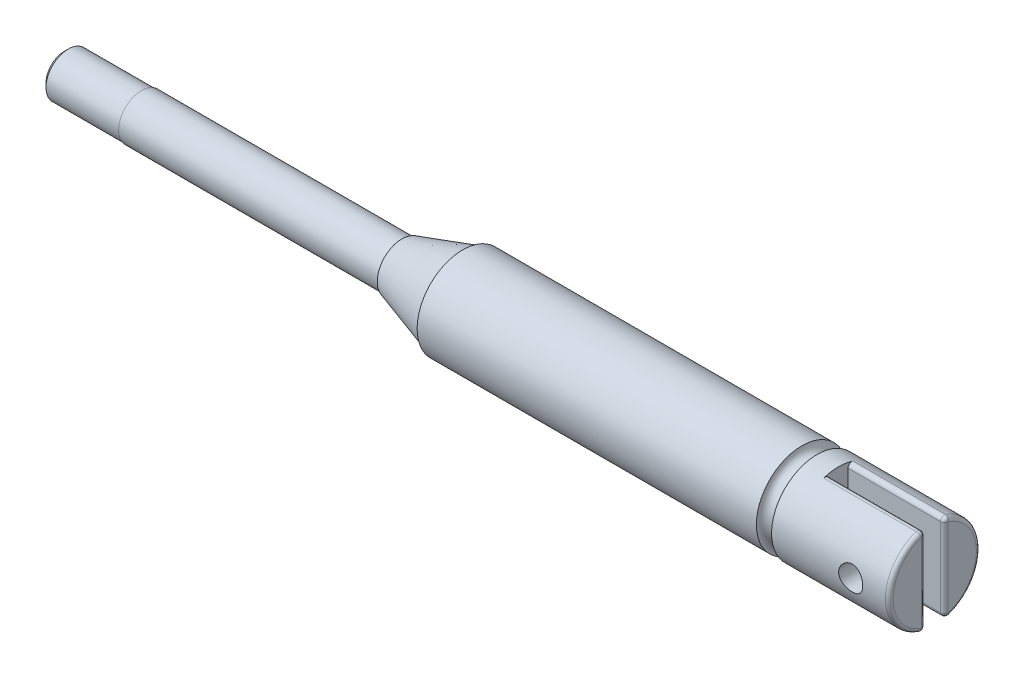
ISO-10303-21;
HEADER;
FILE_DESCRIPTION(('STEP AP214'),'2;1');
FILE_NAME('part.step','',(''),(''),'','','');
FILE_SCHEMA(('AUTOMOTIVE_DESIGN { 1 0 10303 214 1 1 1 1 }'));
ENDSEC;
DATA;
#1=APPLICATION_CONTEXT('core data for automotive mechanical design processes');
#2=APPLICATION_PROTOCOL_DEFINITION('international standard','automotive_design',2000,#1);
#3=PRODUCT_CONTEXT('',#1,'mechanical');
#4=PRODUCT('Part','Part','',(#3));
#5=PRODUCT_RELATED_PRODUCT_CATEGORY('part','',(#4));
#6=PRODUCT_DEFINITION_FORMATION('','',#4);
#7=PRODUCT_DEFINITION_CONTEXT('part definition',#1,'design');
#8=PRODUCT_DEFINITION('design','',#6,#7);
#9=PRODUCT_DEFINITION_SHAPE('','',#8);
#10=(LENGTH_UNIT() NAMED_UNIT(*) SI_UNIT(.MILLI.,.METRE.));
#11=(NAMED_UNIT(*) PLANE_ANGLE_UNIT() SI_UNIT($,.RADIAN.));
#12=(NAMED_UNIT(*) SI_UNIT($,.STERADIAN.) SOLID_ANGLE_UNIT());
#13=UNCERTAINTY_MEASURE_WITH_UNIT(LENGTH_MEASURE(1.E-05),#10,'distance_accuracy_value','');
#14=(GEOMETRIC_REPRESENTATION_CONTEXT(3) GLOBAL_UNCERTAINTY_ASSIGNED_CONTEXT((#13)) GLOBAL_UNIT_ASSIGNED_CONTEXT((#10,
#11,#12)) REPRESENTATION_CONTEXT('',''));
#15=CARTESIAN_POINT('',(0.,0.,0.));
#16=DIRECTION('',(0.,0.,1.));
#17=DIRECTION('',(1.,0.,0.));
#18=AXIS2_PLACEMENT_3D('',#15,#16,#17);
#19=CARTESIAN_POINT('',(-76.0312923411787,0.,0.));
#20=DIRECTION('',(-1.,0.,0.));
#21=DIRECTION('',(0.,-1.,0.));
#22=AXIS2_PLACEMENT_3D('',#19,#20,#21);
#23=CYLINDRICAL_SURFACE('',#22,1.49999999999999);
#24=CARTESIAN_POINT('',(-52.28844,0.,0.));
#25=DIRECTION('',(-1.,0.,0.));
#26=DIRECTION('',(0.,-1.,0.));
#27=AXIS2_PLACEMENT_3D('',#24,#25,#26);
#28=CIRCLE('',#27,1.50000000000001);
#29=CARTESIAN_POINT('',(-52.28844,-1.50000000000001,0.));
#30=VERTEX_POINT('',#29);
#31=EDGE_CURVE('E327',#30,#30,#28,.T.);
#32=ORIENTED_EDGE('',*,*,#31,.F.);
#33=EDGE_LOOP('',(#32));
#34=FACE_BOUND('',#33,.T.);
#35=CARTESIAN_POINT('',(-35.114992,0.,0.));
#36=DIRECTION('',(-1.,0.,0.));
#37=DIRECTION('',(0.,-1.,0.));
#38=AXIS2_PLACEMENT_3D('',#35,#36,#37);
#39=CIRCLE('',#38,1.49999999999999);
#40=CARTESIAN_POINT('',(-35.114992,-1.49999999999998,0.));
#41=VERTEX_POINT('',#40);
#42=EDGE_CURVE('E320',#41,#41,#39,.T.);
#43=ORIENTED_EDGE('',*,*,#42,.T.);
#44=EDGE_LOOP('',(#43));
#45=FACE_BOUND('',#44,.T.);
#46=ADVANCED_FACE('F37',(#34,#45),#23,.T.);
#47=CARTESIAN_POINT('',(-35.114992,1.627,0.));
#48=DIRECTION('',(1.,0.,0.));
#49=DIRECTION('',(0.,1.,0.));
#50=AXIS2_PLACEMENT_3D('',#47,#48,#49);
#51=PLANE('',#50);
#52=ORIENTED_EDGE('',*,*,#42,.F.);
#53=EDGE_LOOP('',(#52));
#54=FACE_BOUND('',#53,.T.);
#55=CARTESIAN_POINT('',(-35.114992,0.,0.));
#56=DIRECTION('',(-1.,0.,0.));
#57=DIRECTION('',(0.,-1.,0.));
#58=AXIS2_PLACEMENT_3D('',#55,#56,#57);
#59=CIRCLE('',#58,1.62699999999999);
#60=CARTESIAN_POINT('',(-35.114992,-1.62699999999998,0.));
#61=VERTEX_POINT('',#60);
#62=EDGE_CURVE('E567',#61,#61,#59,.T.);
#63=ORIENTED_EDGE('',*,*,#62,.T.);
#64=EDGE_LOOP('',(#63));
#65=FACE_BOUND('',#64,.T.);
#66=ADVANCED_FACE('F235',(#54,#65),#51,.F.);
#67=CARTESIAN_POINT('',(-31.115,0.,0.));
#68=DIRECTION('',(1.,0.,0.));
#69=DIRECTION('',(0.,1.,0.));
#70=AXIS2_PLACEMENT_3D('',#67,#68,#69);
#71=CONICAL_SURFACE('',#70,2.87299999999999,0.301974145053179);
#72=ORIENTED_EDGE('',*,*,#62,.F.);
#73=EDGE_LOOP('',(#72));
#74=FACE_BOUND('',#73,.T.);
#75=CARTESIAN_POINT('',(-31.115,0.,0.));
#76=DIRECTION('',(-1.,0.,0.));
#77=DIRECTION('',(0.,-1.,0.));
#78=AXIS2_PLACEMENT_3D('',#75,#76,#77);
#79=CIRCLE('',#78,2.87299999999999);
#80=CARTESIAN_POINT('',(-31.115,-2.87299999999998,0.));
#81=VERTEX_POINT('',#80);
#82=EDGE_CURVE('E562',#81,#81,#79,.T.);
#83=ORIENTED_EDGE('',*,*,#82,.T.);
#84=EDGE_LOOP('',(#83));
#85=FACE_BOUND('',#84,.T.);
#86=ADVANCED_FACE('F241',(#74,#85),#71,.T.);
#87=CARTESIAN_POINT('',(-31.115,3.,0.));
#88=DIRECTION('',(1.,0.,0.));
#89=DIRECTION('',(0.,1.,0.));
#90=AXIS2_PLACEMENT_3D('',#87,#88,#89);
#91=PLANE('',#90);
#92=ORIENTED_EDGE('',*,*,#82,.F.);
#93=EDGE_LOOP('',(#92));
#94=FACE_BOUND('',#93,.T.);
#95=CARTESIAN_POINT('',(-31.115,0.,0.));
#96=DIRECTION('',(-1.,0.,0.));
#97=DIRECTION('',(0.,-1.,0.));
#98=AXIS2_PLACEMENT_3D('',#95,#96,#97);
#99=CIRCLE('',#98,2.99999999999999);
#100=CARTESIAN_POINT('',(-31.115,-2.99999999999998,0.));
#101=VERTEX_POINT('',#100);
#102=EDGE_CURVE('E308',#101,#101,#99,.T.);
#103=ORIENTED_EDGE('',*,*,#102,.T.);
#104=EDGE_LOOP('',(#103));
#105=FACE_BOUND('',#104,.T.);
#106=ADVANCED_FACE('F460',(#94,#105),#91,.F.);
#107=CARTESIAN_POINT('',(-76.0312923411787,0.,0.));
#108=DIRECTION('',(-1.,0.,0.));
#109=DIRECTION('',(0.,-1.,0.));
#110=AXIS2_PLACEMENT_3D('',#107,#108,#109);
#111=CYLINDRICAL_SURFACE('',#110,2.99999999999999);
#112=CARTESIAN_POINT('',(-8.755,0.,0.));
#113=DIRECTION('',(1.,0.,0.));
#114=DIRECTION('',(0.,1.,0.));
#115=AXIS2_PLACEMENT_3D('',#112,#113,#114);
#116=CIRCLE('',#115,2.99999999999999);
#117=CARTESIAN_POINT('',(-8.755,3.,0.));
#118=VERTEX_POINT('',#117);
#119=EDGE_CURVE('E209',#118,#118,#116,.F.);
#120=ORIENTED_EDGE('',*,*,#119,.T.);
#121=EDGE_LOOP('',(#120));
#122=FACE_BOUND('',#121,.T.);
#123=ORIENTED_EDGE('',*,*,#102,.F.);
#124=EDGE_LOOP('',(#123));
#125=FACE_BOUND('',#124,.T.);
#126=ADVANCED_FACE('F336',(#122,#125),#111,.T.);
#127=CARTESIAN_POINT('',(-63.4330682425012,0.,0.));
#128=DIRECTION('',(-1.,0.,0.));
#129=DIRECTION('',(0.,-1.,0.));
#130=AXIS2_PLACEMENT_3D('',#127,#128,#129);
#131=CYLINDRICAL_SURFACE('',#130,1.4605);
#132=CARTESIAN_POINT('',(-57.11444,0.,0.));
#133=DIRECTION('',(1.,0.,0.));
#134=DIRECTION('',(0.,1.,0.));
#135=AXIS2_PLACEMENT_3D('',#132,#133,#134);
#136=CIRCLE('',#135,1.4605);
#137=CARTESIAN_POINT('',(-57.11444,1.4605,0.));
#138=VERTEX_POINT('',#137);
#139=EDGE_CURVE('E148',#138,#138,#136,.T.);
#140=ORIENTED_EDGE('',*,*,#139,.T.);
#141=EDGE_LOOP('',(#140));
#142=FACE_BOUND('',#141,.T.);
#143=CARTESIAN_POINT('',(-52.28844,0.,0.));
#144=DIRECTION('',(-1.,0.,0.));
#145=DIRECTION('',(0.,-1.,0.));
#146=AXIS2_PLACEMENT_3D('',#143,#144,#145);
#147=CIRCLE('',#146,1.4605);
#148=CARTESIAN_POINT('',(-52.28844,-1.4605,0.));
#149=VERTEX_POINT('',#148);
#150=EDGE_CURVE('E196',#149,#149,#147,.T.);
#151=ORIENTED_EDGE('',*,*,#150,.T.);
#152=EDGE_LOOP('',(#151));
#153=FACE_BOUND('',#152,.T.);
#154=ADVANCED_FACE('F331',(#142,#153),#131,.T.);
#155=CARTESIAN_POINT('',(-52.28844,1.50000000000001,0.));
#156=DIRECTION('',(1.,0.,0.));
#157=DIRECTION('',(0.,1.,0.));
#158=AXIS2_PLACEMENT_3D('',#155,#156,#157);
#159=PLANE('',#158);
#160=ORIENTED_EDGE('',*,*,#150,.F.);
#161=EDGE_LOOP('',(#160));
#162=FACE_BOUND('',#161,.T.);
#163=ORIENTED_EDGE('',*,*,#31,.T.);
#164=EDGE_LOOP('',(#163));
#165=FACE_BOUND('',#164,.T.);
#166=ADVANCED_FACE('F249',(#162,#165),#159,.F.);
#167=CARTESIAN_POINT('',(-57.36844,0.,0.));
#168=DIRECTION('',(1.,0.,0.));
#169=DIRECTION('',(0.,1.,0.));
#170=AXIS2_PLACEMENT_3D('',#167,#168,#169);
#171=PLANE('',#170);
#172=CARTESIAN_POINT('',(-57.36844,0.,0.));
#173=DIRECTION('',(1.,0.,0.));
#174=DIRECTION('',(0.,1.,0.));
#175=AXIS2_PLACEMENT_3D('',#172,#173,#174);
#176=CIRCLE('',#175,1.20649999999999);
#177=CARTESIAN_POINT('',(-57.36844,1.20649999999999,0.));
#178=VERTEX_POINT('',#177);
#179=EDGE_CURVE('E315',#178,#178,#176,.F.);
#180=ORIENTED_EDGE('',*,*,#179,.T.);
#181=EDGE_LOOP('',(#180));
#182=FACE_BOUND('',#181,.T.);
#183=ADVANCED_FACE('F230',(#182),#171,.F.);
#184=CARTESIAN_POINT('',(-57.36844,0.,0.));
#185=DIRECTION('',(1.,0.,0.));
#186=DIRECTION('',(0.,1.,0.));
#187=AXIS2_PLACEMENT_3D('',#184,#185,#186);
#188=CONICAL_SURFACE('',#187,1.20649999999999,0.785398163397466);
#189=ORIENTED_EDGE('',*,*,#139,.F.);
#190=EDGE_LOOP('',(#189));
#191=FACE_BOUND('',#190,.T.);
#192=ORIENTED_EDGE('',*,*,#179,.F.);
#193=EDGE_LOOP('',(#192));
#194=FACE_BOUND('',#193,.T.);
#195=ADVANCED_FACE('F222',(#191,#194),#188,.T.);
#196=CARTESIAN_POINT('',(-8.255,0.,0.));
#197=DIRECTION('',(1.,0.,0.));
#198=DIRECTION('',(0.,1.,0.));
#199=AXIS2_PLACEMENT_3D('',#196,#197,#198);
#200=TOROIDAL_SURFACE('',#199,2.99999999999999,0.500000000000001);
#201=ORIENTED_EDGE('',*,*,#119,.F.);
#202=EDGE_LOOP('',(#201));
#203=FACE_BOUND('',#202,.T.);
#204=CARTESIAN_POINT('',(-7.755,0.,0.));
#205=DIRECTION('',(-1.,0.,0.));
#206=DIRECTION('',(0.,-1.,0.));
#207=AXIS2_PLACEMENT_3D('',#204,#205,#206);
#208=CIRCLE('',#207,2.99999999999999);
#209=CARTESIAN_POINT('',(-7.755,-2.99999999999997,0.));
#210=VERTEX_POINT('',#209);
#211=EDGE_CURVE('E41',#210,#210,#208,.F.);
#212=ORIENTED_EDGE('',*,*,#211,.F.);
#213=EDGE_LOOP('',(#212));
#214=FACE_BOUND('',#213,.T.);
#215=ADVANCED_FACE('F219',(#203,#214),#200,.F.);
#216=CARTESIAN_POINT('',(-0.254,0.,0.889));
#217=DIRECTION('',(0.,1.,0.));
#218=DIRECTION('',(-1.,0.,0.));
#219=AXIS2_PLACEMENT_3D('',#216,#217,#218);
#220=CYLINDRICAL_SURFACE('',#219,0.254);
#221=CARTESIAN_POINT('',(-0.253999999999999,-2.59811373884976,0.889));
#222=DIRECTION('',(0.,-1.,0.));
#223=DIRECTION('',(1.,0.,0.));
#224=AXIS2_PLACEMENT_3D('',#221,#222,#223);
#225=CIRCLE('',#224,0.254);
#226=CARTESIAN_POINT('',(0.,-2.59811373884976,0.889));
#227=VERTEX_POINT('',#226);
#228=CARTESIAN_POINT('',(-0.253999999999999,-2.59811373884976,0.635));
#229=VERTEX_POINT('',#228);
#230=EDGE_CURVE('E54',#227,#229,#225,.F.);
#231=ORIENTED_EDGE('',*,*,#230,.T.);
#232=DIRECTION('',(0.,1.,0.));
#233=VECTOR('',#232,1.);
#234=CARTESIAN_POINT('',(-0.253999999999999,-2.99999999999998,0.635));
#235=LINE('',#234,#233);
#236=CARTESIAN_POINT('',(-0.254,2.59811373884978,0.635));
#237=VERTEX_POINT('',#236);
#238=EDGE_CURVE('E179',#237,#229,#235,.F.);
#239=ORIENTED_EDGE('',*,*,#238,.F.);
#240=CARTESIAN_POINT('',(-0.254,2.59811373884978,0.889));
#241=DIRECTION('',(0.,1.,0.));
#242=DIRECTION('',(0.,0.,1.));
#243=AXIS2_PLACEMENT_3D('',#240,#241,#242);
#244=CIRCLE('',#243,0.254);
#245=CARTESIAN_POINT('',(0.,2.59811373884978,0.889));
#246=VERTEX_POINT('',#245);
#247=EDGE_CURVE('E197',#237,#246,#244,.F.);
#248=ORIENTED_EDGE('',*,*,#247,.T.);
#249=DIRECTION('',(0.,1.,0.));
#250=VECTOR('',#249,1.);
#251=CARTESIAN_POINT('',(0.,0.,0.889));
#252=LINE('',#251,#250);
#253=EDGE_CURVE('E175',#227,#246,#252,.T.);
#254=ORIENTED_EDGE('',*,*,#253,.F.);
#255=EDGE_LOOP('',(#231,#239,#248,#254));
#256=FACE_BOUND('',#255,.T.);
#257=ADVANCED_FACE('F221',(#256),#220,.T.);
#258=CARTESIAN_POINT('',(-0.254,0.,-0.889));
#259=DIRECTION('',(0.,-1.,0.));
#260=DIRECTION('',(1.,0.,0.));
#261=AXIS2_PLACEMENT_3D('',#258,#259,#260);
#262=CYLINDRICAL_SURFACE('',#261,0.254);
#263=CARTESIAN_POINT('',(-0.254,2.59811373884978,-0.889));
#264=DIRECTION('',(0.,1.,0.));
#265=DIRECTION('',(-1.,0.,0.));
#266=AXIS2_PLACEMENT_3D('',#263,#264,#265);
#267=CIRCLE('',#266,0.254);
#268=CARTESIAN_POINT('',(0.,2.59811373884978,-0.889));
#269=VERTEX_POINT('',#268);
#270=CARTESIAN_POINT('',(-0.254,2.59811373884978,-0.635));
#271=VERTEX_POINT('',#270);
#272=EDGE_CURVE('E129',#269,#271,#267,.F.);
#273=ORIENTED_EDGE('',*,*,#272,.T.);
#274=DIRECTION('',(0.,-1.,0.));
#275=VECTOR('',#274,1.);
#276=CARTESIAN_POINT('',(-0.253999999999999,-2.99999999999998,-0.635));
#277=LINE('',#276,#275);
#278=CARTESIAN_POINT('',(-0.253999999999999,-2.59811373884976,-0.635));
#279=VERTEX_POINT('',#278);
#280=EDGE_CURVE('E126',#279,#271,#277,.F.);
#281=ORIENTED_EDGE('',*,*,#280,.F.);
#282=CARTESIAN_POINT('',(-0.253999999999999,-2.59811373884976,-0.889));
#283=DIRECTION('',(0.,-1.,0.));
#284=DIRECTION('',(0.,0.,-1.));
#285=AXIS2_PLACEMENT_3D('',#282,#283,#284);
#286=CIRCLE('',#285,0.254);
#287=CARTESIAN_POINT('',(0.,-2.59811373884976,-0.889));
#288=VERTEX_POINT('',#287);
#289=EDGE_CURVE('E120',#279,#288,#286,.F.);
#290=ORIENTED_EDGE('',*,*,#289,.T.);
#291=DIRECTION('',(0.,-1.,0.));
#292=VECTOR('',#291,1.);
#293=CARTESIAN_POINT('',(0.,0.,-0.889));
#294=LINE('',#293,#292);
#295=EDGE_CURVE('E124',#269,#288,#294,.T.);
#296=ORIENTED_EDGE('',*,*,#295,.F.);
#297=EDGE_LOOP('',(#273,#281,#290,#296));
#298=FACE_BOUND('',#297,.T.);
#299=ADVANCED_FACE('F122',(#298),#262,.T.);
#300=CARTESIAN_POINT('',(0.,0.,0.));
#301=DIRECTION('',(-1.,0.,0.));
#302=DIRECTION('',(0.,-1.,0.));
#303=AXIS2_PLACEMENT_3D('',#300,#301,#302);
#304=PLANE('',#303);
#305=CARTESIAN_POINT('',(0.,0.,0.));
#306=DIRECTION('',(-1.,0.,0.));
#307=DIRECTION('',(0.,-1.,0.));
#308=AXIS2_PLACEMENT_3D('',#305,#306,#307);
#309=CIRCLE('',#308,2.74599999999999);
#310=EDGE_CURVE('E143',#288,#269,#309,.F.);
#311=ORIENTED_EDGE('',*,*,#310,.T.);
#312=ORIENTED_EDGE('',*,*,#295,.T.);
#313=EDGE_LOOP('',(#311,#312));
#314=FACE_BOUND('',#313,.T.);
#315=ADVANCED_FACE('F150',(#314),#304,.F.);
#316=CARTESIAN_POINT('',(-0.254,2.59811373884978,-0.889));
#317=DIRECTION('',(0.,0.,1.));
#318=DIRECTION('',(1.,0.,0.));
#319=AXIS2_PLACEMENT_3D('',#316,#317,#318);
#320=SPHERICAL_SURFACE('',#319,0.254);
#321=CARTESIAN_POINT('',(-0.254,2.59811373884978,-0.889));
#322=DIRECTION('',(0.,0.323743627093956,0.946144842989724));
#323=DIRECTION('',(0.,-0.946144842989724,0.323743627093956));
#324=AXIS2_PLACEMENT_3D('',#321,#322,#323);
#325=CIRCLE('',#324,0.254);
#326=CARTESIAN_POINT('',(-0.254000000000005,2.83843452896917,-0.971230881281865));
#327=VERTEX_POINT('',#326);
#328=EDGE_CURVE('E140',#269,#327,#325,.T.);
#329=ORIENTED_EDGE('',*,*,#328,.T.);
#330=CARTESIAN_POINT('',(-0.254000000000005,2.59811373884978,-0.889));
#331=DIRECTION('',(1.,0.,0.));
#332=DIRECTION('',(0.,0.,-1.));
#333=AXIS2_PLACEMENT_3D('',#330,#331,#332);
#334=CIRCLE('',#333,0.254);
#335=EDGE_CURVE('E193',#327,#271,#334,.T.);
#336=ORIENTED_EDGE('',*,*,#335,.T.);
#337=ORIENTED_EDGE('',*,*,#272,.F.);
#338=EDGE_LOOP('',(#329,#336,#337));
#339=FACE_BOUND('',#338,.T.);
#340=ADVANCED_FACE('F258',(#339),#320,.T.);
#341=CARTESIAN_POINT('',(0.,0.,0.));
#342=DIRECTION('',(-1.,0.,0.));
#343=DIRECTION('',(0.,-1.,0.));
#344=AXIS2_PLACEMENT_3D('',#341,#342,#343);
#345=CIRCLE('',#344,2.74599999999999);
#346=EDGE_CURVE('E173',#246,#227,#345,.F.);
#347=ORIENTED_EDGE('',*,*,#346,.T.);
#348=ORIENTED_EDGE('',*,*,#253,.T.);
#349=EDGE_LOOP('',(#347,#348));
#350=FACE_BOUND('',#349,.T.);
#351=ADVANCED_FACE('F261',(#350),#304,.F.);
#352=CARTESIAN_POINT('',(-0.254,2.59811373884978,0.889));
#353=DIRECTION('',(0.,0.,1.));
#354=DIRECTION('',(1.,0.,0.));
#355=AXIS2_PLACEMENT_3D('',#352,#353,#354);
#356=SPHERICAL_SURFACE('',#355,0.254);
#357=CARTESIAN_POINT('',(-0.254,2.59811373884978,0.889));
#358=DIRECTION('',(1.,0.,0.));
#359=DIRECTION('',(0.,1.,0.));
#360=AXIS2_PLACEMENT_3D('',#357,#358,#359);
#361=CIRCLE('',#360,0.254);
#362=CARTESIAN_POINT('',(-0.254000000000005,2.83843452896917,0.971230881281865));
#363=VERTEX_POINT('',#362);
#364=EDGE_CURVE('E200',#237,#363,#361,.T.);
#365=ORIENTED_EDGE('',*,*,#364,.T.);
#366=CARTESIAN_POINT('',(-0.254000000000005,2.59811373884978,0.889));
#367=DIRECTION('',(0.,0.323743627093956,-0.946144842989724));
#368=DIRECTION('',(0.,0.946144842989724,0.323743627093956));
#369=AXIS2_PLACEMENT_3D('',#366,#367,#368);
#370=CIRCLE('',#369,0.254);
#371=EDGE_CURVE('E203',#363,#246,#370,.T.);
#372=ORIENTED_EDGE('',*,*,#371,.T.);
#373=ORIENTED_EDGE('',*,*,#247,.F.);
#374=EDGE_LOOP('',(#365,#372,#373));
#375=FACE_BOUND('',#374,.T.);
#376=ADVANCED_FACE('F276',(#375),#356,.T.);
#377=CARTESIAN_POINT('',(-0.253999999999999,-2.59811373884976,0.889));
#378=DIRECTION('',(0.,0.,1.));
#379=DIRECTION('',(1.,0.,0.));
#380=AXIS2_PLACEMENT_3D('',#377,#378,#379);
#381=SPHERICAL_SURFACE('',#380,0.254);
#382=CARTESIAN_POINT('',(-0.253999999999999,-2.59811373884976,0.889));
#383=DIRECTION('',(0.,-0.323743627093956,-0.946144842989724));
#384=DIRECTION('',(0.,0.946144842989724,-0.323743627093956));
#385=AXIS2_PLACEMENT_3D('',#382,#383,#384);
#386=CIRCLE('',#385,0.254);
#387=CARTESIAN_POINT('',(-0.254000000000004,-2.83843452896915,0.971230881281865));
#388=VERTEX_POINT('',#387);
#389=EDGE_CURVE('E206',#227,#388,#386,.T.);
#390=ORIENTED_EDGE('',*,*,#389,.T.);
#391=CARTESIAN_POINT('',(-0.254000000000004,-2.59811373884976,0.889));
#392=DIRECTION('',(1.,0.,0.));
#393=DIRECTION('',(0.,0.,-1.));
#394=AXIS2_PLACEMENT_3D('',#391,#392,#393);
#395=CIRCLE('',#394,0.254);
#396=EDGE_CURVE('E130',#388,#229,#395,.T.);
#397=ORIENTED_EDGE('',*,*,#396,.T.);
#398=ORIENTED_EDGE('',*,*,#230,.F.);
#399=EDGE_LOOP('',(#390,#397,#398));
#400=FACE_BOUND('',#399,.T.);
#401=ADVANCED_FACE('F279',(#400),#381,.T.);
#402=CARTESIAN_POINT('',(-6.35,-2.99999999999998,0.635));
#403=DIRECTION('',(0.,0.,1.));
#404=DIRECTION('',(1.,0.,0.));
#405=AXIS2_PLACEMENT_3D('',#402,#403,#404);
#406=PLANE('',#405);
#407=CARTESIAN_POINT('',(-2.54,0.,0.635));
#408=DIRECTION('',(0.,0.,1.));
#409=DIRECTION('',(1.,0.,0.));
#410=AXIS2_PLACEMENT_3D('',#407,#408,#409);
#411=CIRCLE('',#410,0.79375);
#412=CARTESIAN_POINT('',(-1.74625,0.,0.635));
#413=VERTEX_POINT('',#412);
#414=EDGE_CURVE('E326',#413,#413,#411,.T.);
#415=ORIENTED_EDGE('',*,*,#414,.T.);
#416=EDGE_LOOP('',(#415));
#417=FACE_BOUND('',#416,.T.);
#418=ORIENTED_EDGE('',*,*,#238,.T.);
#419=DIRECTION('',(-1.,0.,0.));
#420=VECTOR('',#419,1.);
#421=CARTESIAN_POINT('',(-6.35,-2.59811373884976,0.635));
#422=LINE('',#421,#420);
#423=CARTESIAN_POINT('',(-6.35,-2.59811373884976,0.635));
#424=VERTEX_POINT('',#423);
#425=EDGE_CURVE('E181',#229,#424,#422,.T.);
#426=ORIENTED_EDGE('',*,*,#425,.T.);
#427=DIRECTION('',(0.,1.,0.));
#428=VECTOR('',#427,1.);
#429=CARTESIAN_POINT('',(-6.35,-2.99999999999998,0.635));
#430=LINE('',#429,#428);
#431=CARTESIAN_POINT('',(-6.35,2.59811373884978,0.635));
#432=VERTEX_POINT('',#431);
#433=EDGE_CURVE('E304',#424,#432,#430,.T.);
#434=ORIENTED_EDGE('',*,*,#433,.T.);
#435=DIRECTION('',(-1.,0.,0.));
#436=VECTOR('',#435,1.);
#437=CARTESIAN_POINT('',(-6.35,2.59811373884978,0.635));
#438=LINE('',#437,#436);
#439=EDGE_CURVE('E62',#432,#237,#438,.F.);
#440=ORIENTED_EDGE('',*,*,#439,.T.);
#441=EDGE_LOOP('',(#418,#426,#434,#440));
#442=FACE_BOUND('',#441,.T.);
#443=ADVANCED_FACE('F283',(#417,#442),#406,.F.);
#444=CARTESIAN_POINT('',(-6.35,-2.99999999999998,-0.635));
#445=DIRECTION('',(0.,0.,-1.));
#446=DIRECTION('',(-1.,0.,0.));
#447=AXIS2_PLACEMENT_3D('',#444,#445,#446);
#448=PLANE('',#447);
#449=CARTESIAN_POINT('',(-2.54,0.,-0.635));
#450=DIRECTION('',(0.,0.,-1.));
#451=DIRECTION('',(-1.,0.,0.));
#452=AXIS2_PLACEMENT_3D('',#449,#450,#451);
#453=CIRCLE('',#452,0.79375);
#454=CARTESIAN_POINT('',(-3.33375,0.,-0.635));
#455=VERTEX_POINT('',#454);
#456=EDGE_CURVE('E324',#455,#455,#453,.T.);
#457=ORIENTED_EDGE('',*,*,#456,.T.);
#458=EDGE_LOOP('',(#457));
#459=FACE_BOUND('',#458,.T.);
#460=DIRECTION('',(0.,1.,0.));
#461=VECTOR('',#460,1.);
#462=CARTESIAN_POINT('',(-6.35,-2.99999999999998,-0.635));
#463=LINE('',#462,#461);
#464=CARTESIAN_POINT('',(-6.35,-2.59811373884976,-0.635));
#465=VERTEX_POINT('',#464);
#466=CARTESIAN_POINT('',(-6.35,2.59811373884978,-0.635));
#467=VERTEX_POINT('',#466);
#468=EDGE_CURVE('E309',#465,#467,#463,.T.);
#469=ORIENTED_EDGE('',*,*,#468,.F.);
#470=DIRECTION('',(-1.,0.,0.));
#471=VECTOR('',#470,1.);
#472=CARTESIAN_POINT('',(-6.35,-2.59811373884976,-0.635));
#473=LINE('',#472,#471);
#474=EDGE_CURVE('E157',#465,#279,#473,.F.);
#475=ORIENTED_EDGE('',*,*,#474,.T.);
#476=ORIENTED_EDGE('',*,*,#280,.T.);
#477=DIRECTION('',(-1.,0.,0.));
#478=VECTOR('',#477,1.);
#479=CARTESIAN_POINT('',(-6.35,2.59811373884978,-0.635));
#480=LINE('',#479,#478);
#481=EDGE_CURVE('E151',#271,#467,#480,.T.);
#482=ORIENTED_EDGE('',*,*,#481,.T.);
#483=EDGE_LOOP('',(#469,#475,#476,#482));
#484=FACE_BOUND('',#483,.T.);
#485=ADVANCED_FACE('F257',(#459,#484),#448,.F.);
#486=CARTESIAN_POINT('',(-0.253999999999999,-2.59811373884976,-0.889));
#487=DIRECTION('',(0.,0.,1.));
#488=DIRECTION('',(1.,0.,0.));
#489=AXIS2_PLACEMENT_3D('',#486,#487,#488);
#490=SPHERICAL_SURFACE('',#489,0.254);
#491=CARTESIAN_POINT('',(-0.253999999999999,-2.59811373884976,-0.889));
#492=DIRECTION('',(1.,0.,0.));
#493=DIRECTION('',(0.,1.,0.));
#494=AXIS2_PLACEMENT_3D('',#491,#492,#493);
#495=CIRCLE('',#494,0.254);
#496=CARTESIAN_POINT('',(-0.254000000000004,-2.83843452896915,-0.971230881281865));
#497=VERTEX_POINT('',#496);
#498=EDGE_CURVE('E137',#279,#497,#495,.T.);
#499=ORIENTED_EDGE('',*,*,#498,.T.);
#500=CARTESIAN_POINT('',(-0.254000000000004,-2.59811373884976,-0.889));
#501=DIRECTION('',(0.,-0.323743627093957,0.946144842989724));
#502=DIRECTION('',(0.,-0.946144842989724,-0.323743627093957));
#503=AXIS2_PLACEMENT_3D('',#500,#501,#502);
#504=CIRCLE('',#503,0.254);
#505=EDGE_CURVE('E133',#497,#288,#504,.T.);
#506=ORIENTED_EDGE('',*,*,#505,.T.);
#507=ORIENTED_EDGE('',*,*,#289,.F.);
#508=EDGE_LOOP('',(#499,#506,#507));
#509=FACE_BOUND('',#508,.T.);
#510=ADVANCED_FACE('F135',(#509),#490,.T.);
#511=CARTESIAN_POINT('',(-2.54,0.,-2.99999999999999));
#512=DIRECTION('',(0.,0.,1.));
#513=DIRECTION('',(1.,0.,0.));
#514=AXIS2_PLACEMENT_3D('',#511,#512,#513);
#515=CYLINDRICAL_SURFACE('',#514,0.79375);
#516=ORIENTED_EDGE('',*,*,#456,.F.);
#517=EDGE_LOOP('',(#516));
#518=FACE_BOUND('',#517,.T.);
#519=CARTESIAN_POINT('',(-1.74625,0.,-2.99999999999999));
#520=CARTESIAN_POINT('',(-1.74625106466458,0.0437698375668157,-2.9999993282264));
#521=CARTESIAN_POINT('',(-1.74988254999377,0.0875511439939445,-2.99903265897856));
#522=CARTESIAN_POINT('',(-1.76428734018329,0.17385336792853,-2.9952702766813));
#523=CARTESIAN_POINT('',(-1.7750641600128,0.216373654348215,-2.99247366344542));
#524=CARTESIAN_POINT('',(-1.80338534416475,0.298895558183938,-2.98536019494753));
#525=CARTESIAN_POINT('',(-1.82092105910498,0.338900318931544,-2.9810452832695));
#526=CARTESIAN_POINT('',(-1.86223040276898,0.415400954854202,-2.97135167835241));
#527=CARTESIAN_POINT('',(-1.88600442136328,0.45189661052852,-2.96597291863203));
#528=CARTESIAN_POINT('',(-1.93968923528594,0.521177198313556,-2.95459529167835));
#529=CARTESIAN_POINT('',(-1.96971606590674,0.553870498840004,-2.948585955456));
#530=CARTESIAN_POINT('',(-2.03480605532623,0.613821062476154,-2.93669198347927));
#531=CARTESIAN_POINT('',(-2.06986985088904,0.641077637242554,-2.93080736359941));
#532=CARTESIAN_POINT('',(-2.14476729320822,0.689825783926276,-2.91972221312683));
#533=CARTESIAN_POINT('',(-2.1846714436118,0.711212314583401,-2.91453490163149));
#534=CARTESIAN_POINT('',(-2.26766841339288,0.746936853108402,-2.90558545856868));
#535=CARTESIAN_POINT('',(-2.31076065333328,0.761276138213968,-2.90182306877781));
#536=CARTESIAN_POINT('',(-2.39789667894256,0.782181634058109,-2.89625748536585));
#537=CARTESIAN_POINT('',(-2.44189791653429,0.788913803347784,-2.89441253550613));
#538=CARTESIAN_POINT('',(-2.53044095911576,0.794931306686499,-2.89276593751789));
#539=CARTESIAN_POINT('',(-2.57498266329633,0.794218008787497,-2.89296391401602));
#540=CARTESIAN_POINT('',(-2.66204993546567,0.785496664193203,-2.89534340740742));
#541=CARTESIAN_POINT('',(-2.70459730494513,0.777689037954792,-2.89747042426131));
#542=CARTESIAN_POINT('',(-2.78775562385429,0.755321500880883,-2.90338112457289));
#543=CARTESIAN_POINT('',(-2.82836642039022,0.740761057876009,-2.90716493859651));
#544=CARTESIAN_POINT('',(-2.90702314199696,0.705136935568971,-2.91601108429069));
#545=CARTESIAN_POINT('',(-2.94503548852245,0.684002677548692,-2.92108717740622));
#546=CARTESIAN_POINT('',(-3.01704483448691,0.635880102873265,-2.93193848850909));
#547=CARTESIAN_POINT('',(-3.05104105267015,0.608890650096443,-2.93771384208226));
#548=CARTESIAN_POINT('',(-3.11519864441466,0.548797335418491,-2.94954012997449));
#549=CARTESIAN_POINT('',(-3.14520196174313,0.515525063857159,-2.95559396059681));
#550=CARTESIAN_POINT('',(-3.19923505967777,0.444347463545209,-2.96712878584985));
#551=CARTESIAN_POINT('',(-3.22326461205786,0.406441957865631,-2.97260975859004));
#552=CARTESIAN_POINT('',(-3.26473616217239,0.326831593122855,-2.98241416327767));
#553=CARTESIAN_POINT('',(-3.28214993361147,0.285111376395161,-2.98673261299293));
#554=CARTESIAN_POINT('',(-3.30967123600047,0.199195346207609,-2.99368936208497));
#555=CARTESIAN_POINT('',(-3.31978033782868,0.155000067217067,-2.99632802268796));
#556=CARTESIAN_POINT('',(-3.3321580429915,0.0667376523615833,-2.99957341029864));
#557=CARTESIAN_POINT('',(-3.33464158096443,0.0227026605941382,-3.00023582426948));
#558=CARTESIAN_POINT('',(-3.33229070813109,-0.065154514564261,-2.99961399386761));
#559=CARTESIAN_POINT('',(-3.32745704105676,-0.108976719129068,-2.99832994733612));
#560=CARTESIAN_POINT('',(-3.31078538041926,-0.194399831758913,-2.99399540566287));
#561=CARTESIAN_POINT('',(-3.29906693342828,-0.23602574225483,-2.99097507794908));
#562=CARTESIAN_POINT('',(-3.26909688819508,-0.316717136609313,-2.98351028151612));
#563=CARTESIAN_POINT('',(-3.25084458770102,-0.355782344712057,-2.97906565972068));
#564=CARTESIAN_POINT('',(-3.20792399340457,-0.431081141367528,-2.96911443505799));
#565=CARTESIAN_POINT('',(-3.18313832885425,-0.467245269078571,-2.9635889383961));
#566=CARTESIAN_POINT('',(-3.12800244880278,-0.534976580546292,-2.95211485449207));
#567=CARTESIAN_POINT('',(-3.09765115191606,-0.566542868814267,-2.94616618516646));
#568=CARTESIAN_POINT('',(-3.03124314635651,-0.625085613836346,-2.93431188392032));
#569=CARTESIAN_POINT('',(-2.9950515704678,-0.651910529668655,-2.92841201919743));
#570=CARTESIAN_POINT('',(-2.91855627980036,-0.699109160049003,-2.91750500029281));
#571=CARTESIAN_POINT('',(-2.8782527386848,-0.719483146894132,-2.9124978084348));
#572=CARTESIAN_POINT('',(-2.79488111093695,-0.753048198559642,-2.90400040127052));
#573=CARTESIAN_POINT('',(-2.75183079398742,-0.766281053140331,-2.9005013849586));
#574=CARTESIAN_POINT('',(-2.66400796337882,-0.785288661572236,-2.89541367903229));
#575=CARTESIAN_POINT('',(-2.61923588440283,-0.791065285289,-2.89382451047521));
#576=CARTESIAN_POINT('',(-2.53079068680283,-0.794890137295294,-2.89277599719909));
#577=CARTESIAN_POINT('',(-2.48712872977834,-0.793181751627871,-2.893249576234));
#578=CARTESIAN_POINT('',(-2.40073930763013,-0.782648683082195,-2.89611640360626));
#579=CARTESIAN_POINT('',(-2.35801181919211,-0.773824177954277,-2.89850960399424));
#580=CARTESIAN_POINT('',(-2.275005182699,-0.749449449904848,-2.90490641512379));
#581=CARTESIAN_POINT('',(-2.23471010853109,-0.733950041015906,-2.90889784323185));
#582=CARTESIAN_POINT('',(-2.15726201415366,-0.696705015333011,-2.91804184333839));
#583=CARTESIAN_POINT('',(-2.12010948089842,-0.674958432791405,-2.92319459483875));
#584=CARTESIAN_POINT('',(-2.04883749080431,-0.625095478483187,-2.93426733469649));
#585=CARTESIAN_POINT('',(-2.01483725139236,-0.596812658972944,-2.94020524062604));
#586=CARTESIAN_POINT('',(-1.95198634295489,-0.534997634358597,-2.9520783115328));
#587=CARTESIAN_POINT('',(-1.92313692379283,-0.501464158860704,-2.95801347549711));
#588=CARTESIAN_POINT('',(-1.87081279392072,-0.429251570229419,-2.96936104731978));
#589=CARTESIAN_POINT('',(-1.84746340971163,-0.390479337398087,-2.97475989094736));
#590=CARTESIAN_POINT('',(-1.80765096430805,-0.309418659439655,-2.98427885720708));
#591=CARTESIAN_POINT('',(-1.79118341749862,-0.267132526308945,-2.98839981231976));
#592=CARTESIAN_POINT('',(-1.76778827306697,-0.187493841983335,-2.99435591929854));
#593=CARTESIAN_POINT('',(-1.75973001069687,-0.150489373439837,-2.99645714060735));
#594=CARTESIAN_POINT('',(-1.74896066930791,-0.075659407131333,-2.99927940540138));
#595=CARTESIAN_POINT('',(-1.74624907971998,-0.0378339881100275,-3.00000058067095));
#596=CARTESIAN_POINT('',(-1.74625,0.,-2.99999999999999));
#597=B_SPLINE_CURVE_WITH_KNOTS('',3,(#519,#520,#521,#522,#523,#524,#525,#526,#527,#528,#529,
#530,#531,#532,#533,#534,#535,#536,#537,#538,#539,#540,#541,#542,#543,#544,#545,#546,#547,#548,
#549,#550,#551,#552,#553,#554,#555,#556,#557,#558,#559,#560,#561,#562,#563,#564,#565,#566,#567,
#568,#569,#570,#571,#572,#573,#574,#575,#576,#577,#578,#579,#580,#581,#582,#583,#584,#585,#586,
#587,#588,#589,#590,#591,#592,#593,#594,#595,#596),.UNSPECIFIED.,.T.,.F.,(4,2,2,2,2,2,2,2,2,2,2,
2,2,2,2,2,2,2,2,2,2,2,2,2,2,2,2,2,2,2,2,2,2,2,2,2,2,2,4),(0.,0.131170778552684,
0.262406131221829,0.393474096165234,0.524550254315586,0.658319122095874,0.792104915603677,
0.928148246343878,1.06416691158815,1.1971571314056,1.33012291564059,1.45944527739847,
1.58877783239871,1.71954988805291,1.85034734099455,1.98534182002352,2.12034145568787,
2.25591076768455,2.39145091664823,2.52313392623773,2.65480355226297,2.78425176587794,
2.91371389663283,3.04568237466845,3.1776765210025,3.31333069649479,3.44897914518969,
3.58382492836286,3.71863688848134,3.84909835252879,3.97955655793919,4.10903870904436,
4.23854088751621,4.37179895192902,4.50508930803182,4.64117339839338,4.77716864961561,
4.89056152297319,5.00394356759626),.UNSPECIFIED.);
#598=CARTESIAN_POINT('',(-1.74625,0.,-2.99999999999999));
#599=VERTEX_POINT('',#598);
#600=EDGE_CURVE('E355',#599,#599,#597,.T.);
#601=ORIENTED_EDGE('',*,*,#600,.F.);
#602=EDGE_LOOP('',(#601));
#603=FACE_BOUND('',#602,.T.);
#604=ADVANCED_FACE('F256',(#518,#603),#515,.F.);
#605=ORIENTED_EDGE('',*,*,#414,.F.);
#606=EDGE_LOOP('',(#605));
#607=FACE_BOUND('',#606,.T.);
#608=CARTESIAN_POINT('',(-1.74625,0.,2.99999999999999));
#609=CARTESIAN_POINT('',(-1.74625106466458,-0.0437698375668021,2.9999993282264));
#610=CARTESIAN_POINT('',(-1.74988254999377,-0.087551143993931,2.99903265897856));
#611=CARTESIAN_POINT('',(-1.76428734018329,-0.173853367928517,2.9952702766813));
#612=CARTESIAN_POINT('',(-1.77506416001279,-0.216373654348202,2.99247366344542));
#613=CARTESIAN_POINT('',(-1.80338534416474,-0.298895558183926,2.98536019494753));
#614=CARTESIAN_POINT('',(-1.82092105910498,-0.338900318931531,2.98104528326949));
#615=CARTESIAN_POINT('',(-1.86223040276898,-0.415400954854191,2.97135167835241));
#616=CARTESIAN_POINT('',(-1.88600442136327,-0.451896610528509,2.96597291863203));
#617=CARTESIAN_POINT('',(-1.93968923528594,-0.521177198313546,2.95459529167835));
#618=CARTESIAN_POINT('',(-1.96971606590673,-0.553870498839994,2.94858595545599));
#619=CARTESIAN_POINT('',(-2.03480605532622,-0.613821062476145,2.93669198347927));
#620=CARTESIAN_POINT('',(-2.06986985088902,-0.641077637242546,2.93080736359941));
#621=CARTESIAN_POINT('',(-2.1447672932082,-0.689825783926269,2.91972221312683));
#622=CARTESIAN_POINT('',(-2.18467144361178,-0.711212314583395,2.91453490163148));
#623=CARTESIAN_POINT('',(-2.26766841339287,-0.746936853108397,2.90558545856868));
#624=CARTESIAN_POINT('',(-2.31076065333327,-0.761276138213964,2.90182306877781));
#625=CARTESIAN_POINT('',(-2.39789667894254,-0.782181634058106,2.89625748536584));
#626=CARTESIAN_POINT('',(-2.44189791653427,-0.788913803347782,2.89441253550612));
#627=CARTESIAN_POINT('',(-2.53044095911575,-0.794931306686499,2.89276593751788));
#628=CARTESIAN_POINT('',(-2.57498266329631,-0.794218008787498,2.89296391401601));
#629=CARTESIAN_POINT('',(-2.66204993546565,-0.785496664193205,2.89534340740741));
#630=CARTESIAN_POINT('',(-2.70459730494512,-0.777689037954794,2.8974704242613));
#631=CARTESIAN_POINT('',(-2.78775562385428,-0.755321500880887,2.90338112457288));
#632=CARTESIAN_POINT('',(-2.82836642039021,-0.740761057876014,2.90716493859651));
#633=CARTESIAN_POINT('',(-2.90702314199694,-0.705136935568977,2.91601108429068));
#634=CARTESIAN_POINT('',(-2.94503548852244,-0.684002677548699,2.92108717740621));
#635=CARTESIAN_POINT('',(-3.0170448344869,-0.635880102873274,2.93193848850908));
#636=CARTESIAN_POINT('',(-3.05104105267014,-0.608890650096453,2.93771384208226));
#637=CARTESIAN_POINT('',(-3.11519864441465,-0.548797335418502,2.94954012997448));
#638=CARTESIAN_POINT('',(-3.14520196174312,-0.51552506385717,2.9555939605968));
#639=CARTESIAN_POINT('',(-3.19923505967776,-0.444347463545221,2.96712878584984));
#640=CARTESIAN_POINT('',(-3.22326461205786,-0.406441957865644,2.97260975859004));
#641=CARTESIAN_POINT('',(-3.26473616217239,-0.326831593122869,2.98241416327766));
#642=CARTESIAN_POINT('',(-3.28214993361146,-0.285111376395175,2.98673261299293));
#643=CARTESIAN_POINT('',(-3.30967123600047,-0.199195346207623,2.99368936208497));
#644=CARTESIAN_POINT('',(-3.31978033782868,-0.155000067217081,2.99632802268796));
#645=CARTESIAN_POINT('',(-3.3321580429915,-0.0667376523615978,2.99957341029864));
#646=CARTESIAN_POINT('',(-3.33464158096443,-0.0227026605941526,3.00023582426948));
#647=CARTESIAN_POINT('',(-3.33229070813109,0.065154514564247,2.99961399386761));
#648=CARTESIAN_POINT('',(-3.32745704105676,0.108976719129054,2.99832994733612));
#649=CARTESIAN_POINT('',(-3.31078538041926,0.1943998317589,2.99399540566287));
#650=CARTESIAN_POINT('',(-3.29906693342828,0.236025742254817,2.99097507794908));
#651=CARTESIAN_POINT('',(-3.26909688819509,0.316717136609301,2.98351028151612));
#652=CARTESIAN_POINT('',(-3.25084458770103,0.355782344712046,2.97906565972068));
#653=CARTESIAN_POINT('',(-3.20792399340458,0.431081141367517,2.96911443505799));
#654=CARTESIAN_POINT('',(-3.18313832885425,0.467245269078561,2.96358893839611));
#655=CARTESIAN_POINT('',(-3.12800244880279,0.534976580546283,2.95211485449207));
#656=CARTESIAN_POINT('',(-3.09765115191607,0.566542868814258,2.94616618516646));
#657=CARTESIAN_POINT('',(-3.03124314635653,0.625085613836337,2.93431188392033));
#658=CARTESIAN_POINT('',(-2.99505157046782,0.651910529668647,2.92841201919743));
#659=CARTESIAN_POINT('',(-2.91855627980037,0.699109160048995,2.91750500029282));
#660=CARTESIAN_POINT('',(-2.87825273868481,0.719483146894126,2.91249780843481));
#661=CARTESIAN_POINT('',(-2.79488111093697,0.753048198559637,2.90400040127053));
#662=CARTESIAN_POINT('',(-2.75183079398744,0.766281053140328,2.90050138495861));
#663=CARTESIAN_POINT('',(-2.66400796337883,0.785288661572234,2.89541367903229));
#664=CARTESIAN_POINT('',(-2.61923588440284,0.791065285288999,2.89382451047522));
#665=CARTESIAN_POINT('',(-2.53079068680285,0.794890137295294,2.8927759971991));
#666=CARTESIAN_POINT('',(-2.48712872977836,0.793181751627872,2.89324957623401));
#667=CARTESIAN_POINT('',(-2.40073930763014,0.782648683082198,2.89611640360626));
#668=CARTESIAN_POINT('',(-2.35801181919212,0.77382417795428,2.89850960399425));
#669=CARTESIAN_POINT('',(-2.27500518269901,0.749449449904853,2.9049064151238));
#670=CARTESIAN_POINT('',(-2.23471010853111,0.733950041015911,2.90889784323186));
#671=CARTESIAN_POINT('',(-2.15726201415367,0.696705015333018,2.91804184333839));
#672=CARTESIAN_POINT('',(-2.12010948089843,0.674958432791412,2.92319459483876));
#673=CARTESIAN_POINT('',(-2.04883749080432,0.625095478483195,2.9342673346965));
#674=CARTESIAN_POINT('',(-2.01483725139237,0.596812658972953,2.94020524062605));
#675=CARTESIAN_POINT('',(-1.9519863429549,0.534997634358607,2.9520783115328));
#676=CARTESIAN_POINT('',(-1.92313692379283,0.501464158860714,2.95801347549712));
#677=CARTESIAN_POINT('',(-1.87081279392072,0.429251570229429,2.96936104731978));
#678=CARTESIAN_POINT('',(-1.84746340971164,0.390479337398098,2.97475989094737));
#679=CARTESIAN_POINT('',(-1.80765096430806,0.309418659439667,2.98427885720708));
#680=CARTESIAN_POINT('',(-1.79118341749863,0.267132526308957,2.98839981231976));
#681=CARTESIAN_POINT('',(-1.76778827306698,0.187493841983348,2.99435591929854));
#682=CARTESIAN_POINT('',(-1.75973001069687,0.15048937343985,2.99645714060735));
#683=CARTESIAN_POINT('',(-1.74896066930791,0.0756594071313466,2.99927940540138));
#684=CARTESIAN_POINT('',(-1.74624907971998,0.0378339881100412,3.00000058067095));
#685=CARTESIAN_POINT('',(-1.74625,0.,2.99999999999999));
#686=B_SPLINE_CURVE_WITH_KNOTS('',3,(#608,#609,#610,#611,#612,#613,#614,#615,#616,#617,#618,
#619,#620,#621,#622,#623,#624,#625,#626,#627,#628,#629,#630,#631,#632,#633,#634,#635,#636,#637,
#638,#639,#640,#641,#642,#643,#644,#645,#646,#647,#648,#649,#650,#651,#652,#653,#654,#655,#656,
#657,#658,#659,#660,#661,#662,#663,#664,#665,#666,#667,#668,#669,#670,#671,#672,#673,#674,#675,
#676,#677,#678,#679,#680,#681,#682,#683,#684,#685),.UNSPECIFIED.,.T.,.F.,(4,2,2,2,2,2,2,2,2,2,2,
2,2,2,2,2,2,2,2,2,2,2,2,2,2,2,2,2,2,2,2,2,2,2,2,2,2,2,4),(0.,0.131170778552684,
0.262406131221829,0.393474096165234,0.524550254315586,0.658319122095874,0.792104915603678,
0.928148246343878,1.06416691158815,1.1971571314056,1.3301229156406,1.45944527739847,
1.58877783239871,1.71954988805291,1.85034734099455,1.98534182002352,2.12034145568787,
2.25591076768455,2.39145091664823,2.52313392623773,2.65480355226297,2.78425176587794,
2.91371389663283,3.04568237466845,3.1776765210025,3.31333069649478,3.44897914518969,
3.58382492836286,3.71863688848134,3.84909835252879,3.9795565579392,4.10903870904436,
4.23854088751621,4.37179895192902,4.50508930803182,4.64117339839338,4.77716864961561,
4.89056152297319,5.00394356759626),.UNSPECIFIED.);
#687=CARTESIAN_POINT('',(-1.74625,0.,2.99999999999999));
#688=VERTEX_POINT('',#687);
#689=EDGE_CURVE('E347',#688,#688,#686,.T.);
#690=ORIENTED_EDGE('',*,*,#689,.F.);
#691=EDGE_LOOP('',(#690));
#692=FACE_BOUND('',#691,.T.);
#693=ADVANCED_FACE('F271',(#607,#692),#515,.F.);
#694=CARTESIAN_POINT('',(-0.254000000000004,0.,0.));
#695=DIRECTION('',(-1.,0.,0.));
#696=DIRECTION('',(0.,-1.,0.));
#697=AXIS2_PLACEMENT_3D('',#694,#695,#696);
#698=TOROIDAL_SURFACE('',#697,2.74599999999999,0.254);
#699=ORIENTED_EDGE('',*,*,#505,.F.);
#700=CARTESIAN_POINT('',(-0.254000000000004,0.,0.));
#701=DIRECTION('',(-1.,0.,0.));
#702=DIRECTION('',(0.,-1.,0.));
#703=AXIS2_PLACEMENT_3D('',#700,#701,#702);
#704=CIRCLE('',#703,2.99999999999999);
#705=EDGE_CURVE('E168',#327,#497,#704,.T.);
#706=ORIENTED_EDGE('',*,*,#705,.F.);
#707=ORIENTED_EDGE('',*,*,#328,.F.);
#708=ORIENTED_EDGE('',*,*,#310,.F.);
#709=EDGE_LOOP('',(#699,#706,#707,#708));
#710=FACE_BOUND('',#709,.T.);
#711=ADVANCED_FACE('F144',(#710),#698,.T.);
#712=CARTESIAN_POINT('',(-76.0312923411787,2.59811373884977,-0.889));
#713=DIRECTION('',(-1.,0.,0.));
#714=DIRECTION('',(0.,-1.,0.));
#715=AXIS2_PLACEMENT_3D('',#712,#713,#714);
#716=CYLINDRICAL_SURFACE('',#715,0.254);
#717=CARTESIAN_POINT('',(-6.34999999999999,2.59811373884978,-0.889));
#718=DIRECTION('',(-1.,0.,0.));
#719=DIRECTION('',(0.,0.,1.));
#720=AXIS2_PLACEMENT_3D('',#717,#718,#719);
#721=CIRCLE('',#720,0.254);
#722=CARTESIAN_POINT('',(-6.34999999999999,2.83843452896917,-0.971230881281865));
#723=VERTEX_POINT('',#722);
#724=EDGE_CURVE('E46',#467,#723,#721,.T.);
#725=ORIENTED_EDGE('',*,*,#724,.F.);
#726=ORIENTED_EDGE('',*,*,#481,.F.);
#727=ORIENTED_EDGE('',*,*,#335,.F.);
#728=DIRECTION('',(-1.,0.,0.));
#729=VECTOR('',#728,1.);
#730=CARTESIAN_POINT('',(-76.0312923411787,2.83843452896916,-0.971230881281865));
#731=LINE('',#730,#729);
#732=EDGE_CURVE('E166',#723,#327,#731,.F.);
#733=ORIENTED_EDGE('',*,*,#732,.F.);
#734=EDGE_LOOP('',(#725,#726,#727,#733));
#735=FACE_BOUND('',#734,.T.);
#736=ADVANCED_FACE('F270',(#735),#716,.T.);
#737=CARTESIAN_POINT('',(-76.0312923411787,2.59811373884977,0.889));
#738=DIRECTION('',(-1.,0.,0.));
#739=DIRECTION('',(0.,-1.,0.));
#740=AXIS2_PLACEMENT_3D('',#737,#738,#739);
#741=CYLINDRICAL_SURFACE('',#740,0.254);
#742=CARTESIAN_POINT('',(-6.34999999999999,2.59811373884978,0.889));
#743=DIRECTION('',(-1.,0.,0.));
#744=DIRECTION('',(0.,0.,1.));
#745=AXIS2_PLACEMENT_3D('',#742,#743,#744);
#746=CIRCLE('',#745,0.254);
#747=CARTESIAN_POINT('',(-6.34999999999999,2.83843452896917,0.971230881281865));
#748=VERTEX_POINT('',#747);
#749=EDGE_CURVE('E11',#748,#432,#746,.T.);
#750=ORIENTED_EDGE('',*,*,#749,.F.);
#751=DIRECTION('',(-1.,0.,0.));
#752=VECTOR('',#751,1.);
#753=CARTESIAN_POINT('',(-76.0312923411787,2.83843452896916,0.971230881281865));
#754=LINE('',#753,#752);
#755=EDGE_CURVE('E159',#363,#748,#754,.T.);
#756=ORIENTED_EDGE('',*,*,#755,.F.);
#757=ORIENTED_EDGE('',*,*,#364,.F.);
#758=ORIENTED_EDGE('',*,*,#439,.F.);
#759=EDGE_LOOP('',(#750,#756,#757,#758));
#760=FACE_BOUND('',#759,.T.);
#761=ADVANCED_FACE('F273',(#760),#741,.T.);
#762=CARTESIAN_POINT('',(-0.254000000000004,0.,0.));
#763=DIRECTION('',(-1.,0.,0.));
#764=DIRECTION('',(0.,-1.,0.));
#765=AXIS2_PLACEMENT_3D('',#762,#763,#764);
#766=TOROIDAL_SURFACE('',#765,2.74599999999999,0.254);
#767=ORIENTED_EDGE('',*,*,#371,.F.);
#768=CARTESIAN_POINT('',(-0.254000000000004,0.,0.));
#769=DIRECTION('',(-1.,0.,0.));
#770=DIRECTION('',(0.,-1.,0.));
#771=AXIS2_PLACEMENT_3D('',#768,#769,#770);
#772=CIRCLE('',#771,2.99999999999999);
#773=EDGE_CURVE('E162',#388,#363,#772,.T.);
#774=ORIENTED_EDGE('',*,*,#773,.F.);
#775=ORIENTED_EDGE('',*,*,#389,.F.);
#776=ORIENTED_EDGE('',*,*,#346,.F.);
#777=EDGE_LOOP('',(#767,#774,#775,#776));
#778=FACE_BOUND('',#777,.T.);
#779=ADVANCED_FACE('F286',(#778),#766,.T.);
#780=CARTESIAN_POINT('',(-76.0312923411787,-2.59811373884977,0.889));
#781=DIRECTION('',(-1.,0.,0.));
#782=DIRECTION('',(0.,-1.,0.));
#783=AXIS2_PLACEMENT_3D('',#780,#781,#782);
#784=CYLINDRICAL_SURFACE('',#783,0.254);
#785=CARTESIAN_POINT('',(-6.34999999999999,-2.59811373884976,0.889));
#786=DIRECTION('',(-1.,0.,0.));
#787=DIRECTION('',(0.,0.,1.));
#788=AXIS2_PLACEMENT_3D('',#785,#786,#787);
#789=CIRCLE('',#788,0.254);
#790=CARTESIAN_POINT('',(-6.34999999999999,-2.83843452896915,0.971230881281865));
#791=VERTEX_POINT('',#790);
#792=EDGE_CURVE('E185',#424,#791,#789,.T.);
#793=ORIENTED_EDGE('',*,*,#792,.F.);
#794=ORIENTED_EDGE('',*,*,#425,.F.);
#795=ORIENTED_EDGE('',*,*,#396,.F.);
#796=DIRECTION('',(-1.,0.,0.));
#797=VECTOR('',#796,1.);
#798=CARTESIAN_POINT('',(-76.0312923411787,-2.83843452896916,0.971230881281865));
#799=LINE('',#798,#797);
#800=EDGE_CURVE('E164',#791,#388,#799,.F.);
#801=ORIENTED_EDGE('',*,*,#800,.F.);
#802=EDGE_LOOP('',(#793,#794,#795,#801));
#803=FACE_BOUND('',#802,.T.);
#804=ADVANCED_FACE('F39',(#803),#784,.T.);
#805=CARTESIAN_POINT('',(-6.35,-2.99999999999998,0.635));
#806=DIRECTION('',(-1.,0.,0.));
#807=DIRECTION('',(0.,0.,1.));
#808=AXIS2_PLACEMENT_3D('',#805,#806,#807);
#809=PLANE('',#808);
#810=ORIENTED_EDGE('',*,*,#433,.F.);
#811=ORIENTED_EDGE('',*,*,#792,.T.);
#812=CARTESIAN_POINT('',(-6.34999999999999,0.,0.));
#813=DIRECTION('',(-1.,0.,0.));
#814=DIRECTION('',(0.,0.,1.));
#815=AXIS2_PLACEMENT_3D('',#812,#813,#814);
#816=CIRCLE('',#815,2.99999999999999);
#817=CARTESIAN_POINT('',(-6.34999999999999,-2.83843452896915,-0.971230881281865));
#818=VERTEX_POINT('',#817);
#819=EDGE_CURVE('E312',#818,#791,#816,.T.);
#820=ORIENTED_EDGE('',*,*,#819,.F.);
#821=CARTESIAN_POINT('',(-6.34999999999999,-2.59811373884976,-0.889));
#822=DIRECTION('',(-1.,0.,0.));
#823=DIRECTION('',(0.,0.,1.));
#824=AXIS2_PLACEMENT_3D('',#821,#822,#823);
#825=CIRCLE('',#824,0.254);
#826=EDGE_CURVE('E183',#818,#465,#825,.T.);
#827=ORIENTED_EDGE('',*,*,#826,.T.);
#828=ORIENTED_EDGE('',*,*,#468,.T.);
#829=ORIENTED_EDGE('',*,*,#724,.T.);
#830=EDGE_CURVE('E316',#748,#723,#816,.T.);
#831=ORIENTED_EDGE('',*,*,#830,.F.);
#832=ORIENTED_EDGE('',*,*,#749,.T.);
#833=EDGE_LOOP('',(#810,#811,#820,#827,#828,#829,#831,#832));
#834=FACE_BOUND('',#833,.T.);
#835=ADVANCED_FACE('F266',(#834),#809,.F.);
#836=CARTESIAN_POINT('',(-76.0312923411787,-2.59811373884977,-0.889));
#837=DIRECTION('',(-1.,0.,0.));
#838=DIRECTION('',(0.,-1.,0.));
#839=AXIS2_PLACEMENT_3D('',#836,#837,#838);
#840=CYLINDRICAL_SURFACE('',#839,0.254);
#841=ORIENTED_EDGE('',*,*,#826,.F.);
#842=DIRECTION('',(-1.,0.,0.));
#843=VECTOR('',#842,1.);
#844=CARTESIAN_POINT('',(-76.0312923411787,-2.83843452896916,-0.971230881281865));
#845=LINE('',#844,#843);
#846=EDGE_CURVE('E170',#497,#818,#845,.T.);
#847=ORIENTED_EDGE('',*,*,#846,.F.);
#848=ORIENTED_EDGE('',*,*,#498,.F.);
#849=ORIENTED_EDGE('',*,*,#474,.F.);
#850=EDGE_LOOP('',(#841,#847,#848,#849));
#851=FACE_BOUND('',#850,.T.);
#852=ADVANCED_FACE('F263',(#851),#840,.T.);
#853=ORIENTED_EDGE('',*,*,#211,.T.);
#854=EDGE_LOOP('',(#853));
#855=FACE_BOUND('',#854,.T.);
#856=ORIENTED_EDGE('',*,*,#846,.T.);
#857=ORIENTED_EDGE('',*,*,#819,.T.);
#858=ORIENTED_EDGE('',*,*,#800,.T.);
#859=ORIENTED_EDGE('',*,*,#773,.T.);
#860=ORIENTED_EDGE('',*,*,#755,.T.);
#861=ORIENTED_EDGE('',*,*,#830,.T.);
#862=ORIENTED_EDGE('',*,*,#732,.T.);
#863=ORIENTED_EDGE('',*,*,#705,.T.);
#864=EDGE_LOOP('',(#856,#857,#858,#859,#860,#861,#862,#863));
#865=FACE_BOUND('',#864,.T.);
#866=ORIENTED_EDGE('',*,*,#689,.T.);
#867=EDGE_LOOP('',(#866));
#868=FACE_BOUND('',#867,.T.);
#869=ORIENTED_EDGE('',*,*,#600,.T.);
#870=EDGE_LOOP('',(#869));
#871=FACE_BOUND('',#870,.T.);
#872=ADVANCED_FACE('F216',(#855,#865,#868,#871),#111,.T.);
#873=CLOSED_SHELL('',(#46,#66,#86,#106,#126,#154,#166,#183,#195,#215,#257,#299,#315,#340,#351,
#376,#401,#443,#485,#510,#604,#693,#711,#736,#761,#779,#804,#835,#852,#872));
#874=MANIFOLD_SOLID_BREP('B2',#873);
#875=ADVANCED_BREP_SHAPE_REPRESENTATION('',(#18,#874),#14);
#876=SHAPE_DEFINITION_REPRESENTATION(#9,#875);
ENDSEC;
END-ISO-10303-21;
